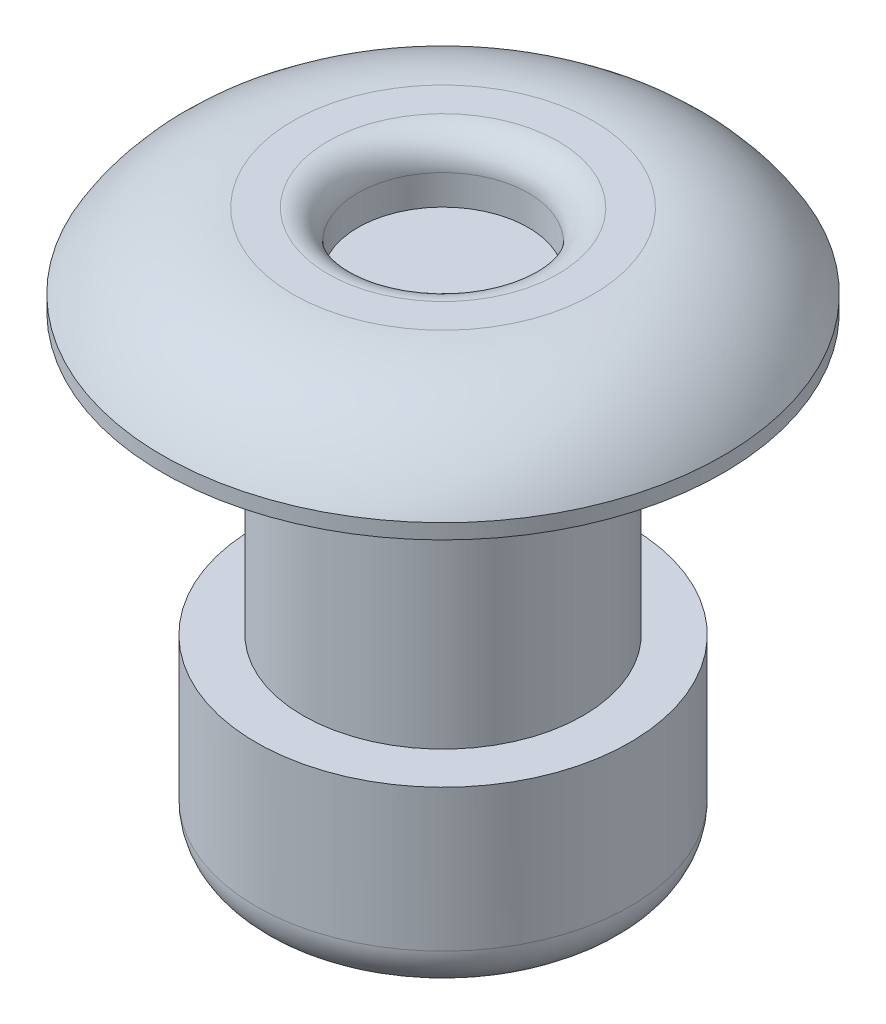
ISO-10303-21;
HEADER;
FILE_DESCRIPTION(('STEP AP214'),'2;1');
FILE_NAME('part.step','',(''),(''),'','','');
FILE_SCHEMA(('AUTOMOTIVE_DESIGN { 1 0 10303 214 1 1 1 1 }'));
ENDSEC;
DATA;
#1=APPLICATION_CONTEXT('core data for automotive mechanical design processes');
#2=APPLICATION_PROTOCOL_DEFINITION('international standard','automotive_design',2000,#1);
#3=PRODUCT_CONTEXT('',#1,'mechanical');
#4=PRODUCT('Part','Part','',(#3));
#5=PRODUCT_RELATED_PRODUCT_CATEGORY('part','',(#4));
#6=PRODUCT_DEFINITION_FORMATION('','',#4);
#7=PRODUCT_DEFINITION_CONTEXT('part definition',#1,'design');
#8=PRODUCT_DEFINITION('design','',#6,#7);
#9=PRODUCT_DEFINITION_SHAPE('','',#8);
#10=(LENGTH_UNIT() NAMED_UNIT(*) SI_UNIT(.MILLI.,.METRE.));
#11=(NAMED_UNIT(*) PLANE_ANGLE_UNIT() SI_UNIT($,.RADIAN.));
#12=(NAMED_UNIT(*) SI_UNIT($,.STERADIAN.) SOLID_ANGLE_UNIT());
#13=UNCERTAINTY_MEASURE_WITH_UNIT(LENGTH_MEASURE(1.E-05),#10,'distance_accuracy_value','');
#14=(GEOMETRIC_REPRESENTATION_CONTEXT(3) GLOBAL_UNCERTAINTY_ASSIGNED_CONTEXT((#13)) GLOBAL_UNIT_ASSIGNED_CONTEXT((#10,
#11,#12)) REPRESENTATION_CONTEXT('',''));
#15=CARTESIAN_POINT('',(0.,0.,0.));
#16=DIRECTION('',(0.,0.,1.));
#17=DIRECTION('',(1.,0.,0.));
#18=AXIS2_PLACEMENT_3D('',#15,#16,#17);
#19=CARTESIAN_POINT('',(0.,1.524,0.));
#20=DIRECTION('',(0.,-1.,0.));
#21=DIRECTION('',(0.,0.,-1.));
#22=AXIS2_PLACEMENT_3D('',#19,#20,#21);
#23=PLANE('',#22);
#24=CARTESIAN_POINT('',(0.,1.524,0.));
#25=DIRECTION('',(0.,-1.,0.));
#26=DIRECTION('',(0.,0.,-1.));
#27=AXIS2_PLACEMENT_3D('',#24,#25,#26);
#28=CIRCLE('',#27,1.9558);
#29=CARTESIAN_POINT('',(0.,1.524,-1.9558));
#30=VERTEX_POINT('',#29);
#31=EDGE_CURVE('E49',#30,#30,#28,.T.);
#32=ORIENTED_EDGE('',*,*,#31,.T.);
#33=EDGE_LOOP('',(#32));
#34=FACE_BOUND('',#33,.T.);
#35=CARTESIAN_POINT('',(0.,1.524,0.));
#36=DIRECTION('',(0.,-1.,0.));
#37=DIRECTION('',(0.,0.,-1.));
#38=AXIS2_PLACEMENT_3D('',#35,#36,#37);
#39=CIRCLE('',#38,2.5527);
#40=CARTESIAN_POINT('',(0.,1.524,-2.5527));
#41=VERTEX_POINT('',#40);
#42=EDGE_CURVE('E57',#41,#41,#39,.T.);
#43=ORIENTED_EDGE('',*,*,#42,.F.);
#44=EDGE_LOOP('',(#43));
#45=FACE_BOUND('',#44,.T.);
#46=ADVANCED_FACE('F34',(#34,#45),#23,.F.);
#47=CARTESIAN_POINT('',(0.,-1.033526,0.));
#48=DIRECTION('',(0.,-1.,0.));
#49=DIRECTION('',(0.,0.,-1.));
#50=AXIS2_PLACEMENT_3D('',#47,#48,#49);
#51=DEGENERATE_TOROIDAL_SURFACE('',#50,2.5527,2.557526,.T.);
#52=CARTESIAN_POINT('',(0.,0.253999999999999,0.));
#53=DIRECTION('',(0.,-1.,0.));
#54=DIRECTION('',(0.,0.,-1.));
#55=AXIS2_PLACEMENT_3D('',#52,#53,#54);
#56=CIRCLE('',#55,4.7625);
#57=CARTESIAN_POINT('',(0.,0.253999999999999,-4.7625));
#58=VERTEX_POINT('',#57);
#59=EDGE_CURVE('E60',#58,#58,#56,.T.);
#60=ORIENTED_EDGE('',*,*,#59,.F.);
#61=EDGE_LOOP('',(#60));
#62=FACE_BOUND('',#61,.T.);
#63=ORIENTED_EDGE('',*,*,#42,.T.);
#64=EDGE_LOOP('',(#63));
#65=FACE_BOUND('',#64,.T.);
#66=ADVANCED_FACE('F100',(#62,#65),#51,.T.);
#67=CARTESIAN_POINT('',(0.,-4.15541832528664,0.));
#68=DIRECTION('',(0.,-1.,0.));
#69=DIRECTION('',(0.,0.,-1.));
#70=AXIS2_PLACEMENT_3D('',#67,#68,#69);
#71=CYLINDRICAL_SURFACE('',#70,4.7625);
#72=CARTESIAN_POINT('',(0.,0.,0.));
#73=DIRECTION('',(0.,-1.,0.));
#74=DIRECTION('',(0.,0.,-1.));
#75=AXIS2_PLACEMENT_3D('',#72,#73,#74);
#76=CIRCLE('',#75,4.7625);
#77=CARTESIAN_POINT('',(0.,0.,-4.7625));
#78=VERTEX_POINT('',#77);
#79=EDGE_CURVE('E63',#78,#78,#76,.T.);
#80=ORIENTED_EDGE('',*,*,#79,.F.);
#81=EDGE_LOOP('',(#80));
#82=FACE_BOUND('',#81,.T.);
#83=ORIENTED_EDGE('',*,*,#59,.T.);
#84=EDGE_LOOP('',(#83));
#85=FACE_BOUND('',#84,.T.);
#86=ADVANCED_FACE('F106',(#82,#85),#71,.T.);
#87=CARTESIAN_POINT('',(0.,0.,0.));
#88=DIRECTION('',(0.,1.,0.));
#89=DIRECTION('',(0.,0.,1.));
#90=AXIS2_PLACEMENT_3D('',#87,#88,#89);
#91=PLANE('',#90);
#92=CARTESIAN_POINT('',(0.,0.,0.));
#93=DIRECTION('',(0.,-1.,0.));
#94=DIRECTION('',(0.,0.,-1.));
#95=AXIS2_PLACEMENT_3D('',#92,#93,#94);
#96=CIRCLE('',#95,2.38125);
#97=CARTESIAN_POINT('',(0.,0.,-2.38125));
#98=VERTEX_POINT('',#97);
#99=EDGE_CURVE('E45',#98,#98,#96,.T.);
#100=ORIENTED_EDGE('',*,*,#99,.F.);
#101=EDGE_LOOP('',(#100));
#102=FACE_BOUND('',#101,.T.);
#103=ORIENTED_EDGE('',*,*,#79,.T.);
#104=EDGE_LOOP('',(#103));
#105=FACE_BOUND('',#104,.T.);
#106=ADVANCED_FACE('F131',(#102,#105),#91,.F.);
#107=CARTESIAN_POINT('',(0.,0.508,0.));
#108=DIRECTION('',(0.,1.,0.));
#109=DIRECTION('',(0.,0.,1.));
#110=AXIS2_PLACEMENT_3D('',#107,#108,#109);
#111=CYLINDRICAL_SURFACE('',#110,1.4478);
#112=CARTESIAN_POINT('',(0.,1.016,0.));
#113=DIRECTION('',(0.,-1.,0.));
#114=DIRECTION('',(0.,0.,-1.));
#115=AXIS2_PLACEMENT_3D('',#112,#113,#114);
#116=CIRCLE('',#115,1.4478);
#117=CARTESIAN_POINT('',(0.,1.016,-1.4478));
#118=VERTEX_POINT('',#117);
#119=EDGE_CURVE('E54',#118,#118,#116,.F.);
#120=ORIENTED_EDGE('',*,*,#119,.T.);
#121=EDGE_LOOP('',(#120));
#122=FACE_BOUND('',#121,.T.);
#123=CARTESIAN_POINT('',(0.,0.508,0.));
#124=DIRECTION('',(0.,1.,0.));
#125=DIRECTION('',(0.,0.,1.));
#126=AXIS2_PLACEMENT_3D('',#123,#124,#125);
#127=CIRCLE('',#126,1.4478);
#128=CARTESIAN_POINT('',(0.,0.508,1.4478));
#129=VERTEX_POINT('',#128);
#130=EDGE_CURVE('E66',#129,#129,#127,.T.);
#131=ORIENTED_EDGE('',*,*,#130,.F.);
#132=EDGE_LOOP('',(#131));
#133=FACE_BOUND('',#132,.T.);
#134=ADVANCED_FACE('F122',(#122,#133),#111,.F.);
#135=CARTESIAN_POINT('',(0.,0.508,0.));
#136=DIRECTION('',(0.,1.,0.));
#137=DIRECTION('',(0.,0.,1.));
#138=AXIS2_PLACEMENT_3D('',#135,#136,#137);
#139=PLANE('',#138);
#140=ORIENTED_EDGE('',*,*,#130,.T.);
#141=EDGE_LOOP('',(#140));
#142=FACE_BOUND('',#141,.T.);
#143=ADVANCED_FACE('F114',(#142),#139,.T.);
#144=CARTESIAN_POINT('',(0.,1.016,0.));
#145=DIRECTION('',(0.,-1.,0.));
#146=DIRECTION('',(0.,0.,-1.));
#147=AXIS2_PLACEMENT_3D('',#144,#145,#146);
#148=TOROIDAL_SURFACE('',#147,1.9558,0.508);
#149=ORIENTED_EDGE('',*,*,#31,.F.);
#150=EDGE_LOOP('',(#149));
#151=FACE_BOUND('',#150,.T.);
#152=ORIENTED_EDGE('',*,*,#119,.F.);
#153=EDGE_LOOP('',(#152));
#154=FACE_BOUND('',#153,.T.);
#155=ADVANCED_FACE('F111',(#151,#154),#148,.T.);
#156=CARTESIAN_POINT('',(0.,0.,0.));
#157=DIRECTION('',(0.,-1.,0.));
#158=DIRECTION('',(0.,0.,-1.));
#159=AXIS2_PLACEMENT_3D('',#156,#157,#158);
#160=CYLINDRICAL_SURFACE('',#159,2.38125);
#161=CARTESIAN_POINT('',(0.,-4.7625,0.));
#162=DIRECTION('',(0.,-1.,0.));
#163=DIRECTION('',(0.,0.,-1.));
#164=AXIS2_PLACEMENT_3D('',#161,#162,#163);
#165=CIRCLE('',#164,2.38125);
#166=CARTESIAN_POINT('',(0.,-4.7625,-2.38125));
#167=VERTEX_POINT('',#166);
#168=EDGE_CURVE('E68',#167,#167,#165,.T.);
#169=ORIENTED_EDGE('',*,*,#168,.F.);
#170=EDGE_LOOP('',(#169));
#171=FACE_BOUND('',#170,.T.);
#172=ORIENTED_EDGE('',*,*,#99,.T.);
#173=EDGE_LOOP('',(#172));
#174=FACE_BOUND('',#173,.T.);
#175=ADVANCED_FACE('F113',(#171,#174),#160,.T.);
#176=CARTESIAN_POINT('',(-2.38125,-4.7625,0.));
#177=DIRECTION('',(0.,-1.,0.));
#178=DIRECTION('',(0.,0.,-1.));
#179=AXIS2_PLACEMENT_3D('',#176,#177,#178);
#180=PLANE('',#179);
#181=CARTESIAN_POINT('',(0.,-4.7625,0.));
#182=DIRECTION('',(0.,-1.,0.));
#183=DIRECTION('',(0.,0.,-1.));
#184=AXIS2_PLACEMENT_3D('',#181,#182,#183);
#185=CIRCLE('',#184,3.175);
#186=CARTESIAN_POINT('',(0.,-4.7625,-3.175));
#187=VERTEX_POINT('',#186);
#188=EDGE_CURVE('E72',#187,#187,#185,.T.);
#189=ORIENTED_EDGE('',*,*,#188,.F.);
#190=EDGE_LOOP('',(#189));
#191=FACE_BOUND('',#190,.T.);
#192=ORIENTED_EDGE('',*,*,#168,.T.);
#193=EDGE_LOOP('',(#192));
#194=FACE_BOUND('',#193,.T.);
#195=ADVANCED_FACE('F97',(#191,#194),#180,.F.);
#196=CARTESIAN_POINT('',(0.,0.,0.));
#197=DIRECTION('',(0.,-1.,0.));
#198=DIRECTION('',(0.,0.,-1.));
#199=AXIS2_PLACEMENT_3D('',#196,#197,#198);
#200=CYLINDRICAL_SURFACE('',#199,3.175);
#201=CARTESIAN_POINT('',(0.,-7.1755,0.));
#202=DIRECTION('',(0.,1.,0.));
#203=DIRECTION('',(0.,0.,1.));
#204=AXIS2_PLACEMENT_3D('',#201,#202,#203);
#205=CIRCLE('',#204,3.175);
#206=CARTESIAN_POINT('',(0.,-7.1755,3.175));
#207=VERTEX_POINT('',#206);
#208=EDGE_CURVE('E10',#207,#207,#205,.T.);
#209=ORIENTED_EDGE('',*,*,#208,.T.);
#210=EDGE_LOOP('',(#209));
#211=FACE_BOUND('',#210,.T.);
#212=ORIENTED_EDGE('',*,*,#188,.T.);
#213=EDGE_LOOP('',(#212));
#214=FACE_BOUND('',#213,.T.);
#215=ADVANCED_FACE('F92',(#211,#214),#200,.T.);
#216=CARTESIAN_POINT('',(-3.175,-7.9375,0.));
#217=DIRECTION('',(0.,1.,0.));
#218=DIRECTION('',(0.,0.,1.));
#219=AXIS2_PLACEMENT_3D('',#216,#217,#218);
#220=PLANE('',#219);
#221=CARTESIAN_POINT('',(0.,-7.9375,0.));
#222=DIRECTION('',(0.,1.,0.));
#223=DIRECTION('',(0.,0.,1.));
#224=AXIS2_PLACEMENT_3D('',#221,#222,#223);
#225=CIRCLE('',#224,2.413);
#226=CARTESIAN_POINT('',(0.,-7.9375,2.413));
#227=VERTEX_POINT('',#226);
#228=EDGE_CURVE('E41',#227,#227,#225,.F.);
#229=ORIENTED_EDGE('',*,*,#228,.T.);
#230=EDGE_LOOP('',(#229));
#231=FACE_BOUND('',#230,.T.);
#232=CARTESIAN_POINT('',(0.,-7.9375,0.));
#233=DIRECTION('',(0.,-1.,0.));
#234=DIRECTION('',(0.,0.,-1.));
#235=AXIS2_PLACEMENT_3D('',#232,#233,#234);
#236=CIRCLE('',#235,1.4478);
#237=CARTESIAN_POINT('',(0.,-7.9375,-1.4478));
#238=VERTEX_POINT('',#237);
#239=EDGE_CURVE('E75',#238,#238,#236,.T.);
#240=ORIENTED_EDGE('',*,*,#239,.F.);
#241=EDGE_LOOP('',(#240));
#242=FACE_BOUND('',#241,.T.);
#243=ADVANCED_FACE('F87',(#231,#242),#220,.F.);
#244=CARTESIAN_POINT('',(0.,0.,0.));
#245=DIRECTION('',(0.,-1.,0.));
#246=DIRECTION('',(0.,0.,-1.));
#247=AXIS2_PLACEMENT_3D('',#244,#245,#246);
#248=CYLINDRICAL_SURFACE('',#247,1.4478);
#249=CARTESIAN_POINT('',(0.,-5.3975,0.));
#250=DIRECTION('',(0.,-1.,0.));
#251=DIRECTION('',(0.,0.,-1.));
#252=AXIS2_PLACEMENT_3D('',#249,#250,#251);
#253=CIRCLE('',#252,1.4478);
#254=CARTESIAN_POINT('',(0.,-5.3975,-1.4478));
#255=VERTEX_POINT('',#254);
#256=EDGE_CURVE('E78',#255,#255,#253,.T.);
#257=ORIENTED_EDGE('',*,*,#256,.F.);
#258=EDGE_LOOP('',(#257));
#259=FACE_BOUND('',#258,.T.);
#260=ORIENTED_EDGE('',*,*,#239,.T.);
#261=EDGE_LOOP('',(#260));
#262=FACE_BOUND('',#261,.T.);
#263=ADVANCED_FACE('F84',(#259,#262),#248,.F.);
#264=CARTESIAN_POINT('',(-1.4478,-5.3975,0.));
#265=DIRECTION('',(0.,1.,0.));
#266=DIRECTION('',(0.,0.,1.));
#267=AXIS2_PLACEMENT_3D('',#264,#265,#266);
#268=PLANE('',#267);
#269=ORIENTED_EDGE('',*,*,#256,.T.);
#270=EDGE_LOOP('',(#269));
#271=FACE_BOUND('',#270,.T.);
#272=ADVANCED_FACE('F82',(#271),#268,.F.);
#273=CARTESIAN_POINT('',(0.,-7.1755,0.));
#274=DIRECTION('',(0.,1.,0.));
#275=DIRECTION('',(0.,0.,1.));
#276=AXIS2_PLACEMENT_3D('',#273,#274,#275);
#277=TOROIDAL_SURFACE('',#276,2.413,0.762);
#278=ORIENTED_EDGE('',*,*,#208,.F.);
#279=EDGE_LOOP('',(#278));
#280=FACE_BOUND('',#279,.T.);
#281=ORIENTED_EDGE('',*,*,#228,.F.);
#282=EDGE_LOOP('',(#281));
#283=FACE_BOUND('',#282,.T.);
#284=ADVANCED_FACE('F36',(#280,#283),#277,.T.);
#285=CLOSED_SHELL('',(#46,#66,#86,#106,#134,#143,#155,#175,#195,#215,#243,#263,#272,#284));
#286=MANIFOLD_SOLID_BREP('B2',#285);
#287=ADVANCED_BREP_SHAPE_REPRESENTATION('',(#18,#286),#14);
#288=SHAPE_DEFINITION_REPRESENTATION(#9,#287);
ENDSEC;
END-ISO-10303-21;
